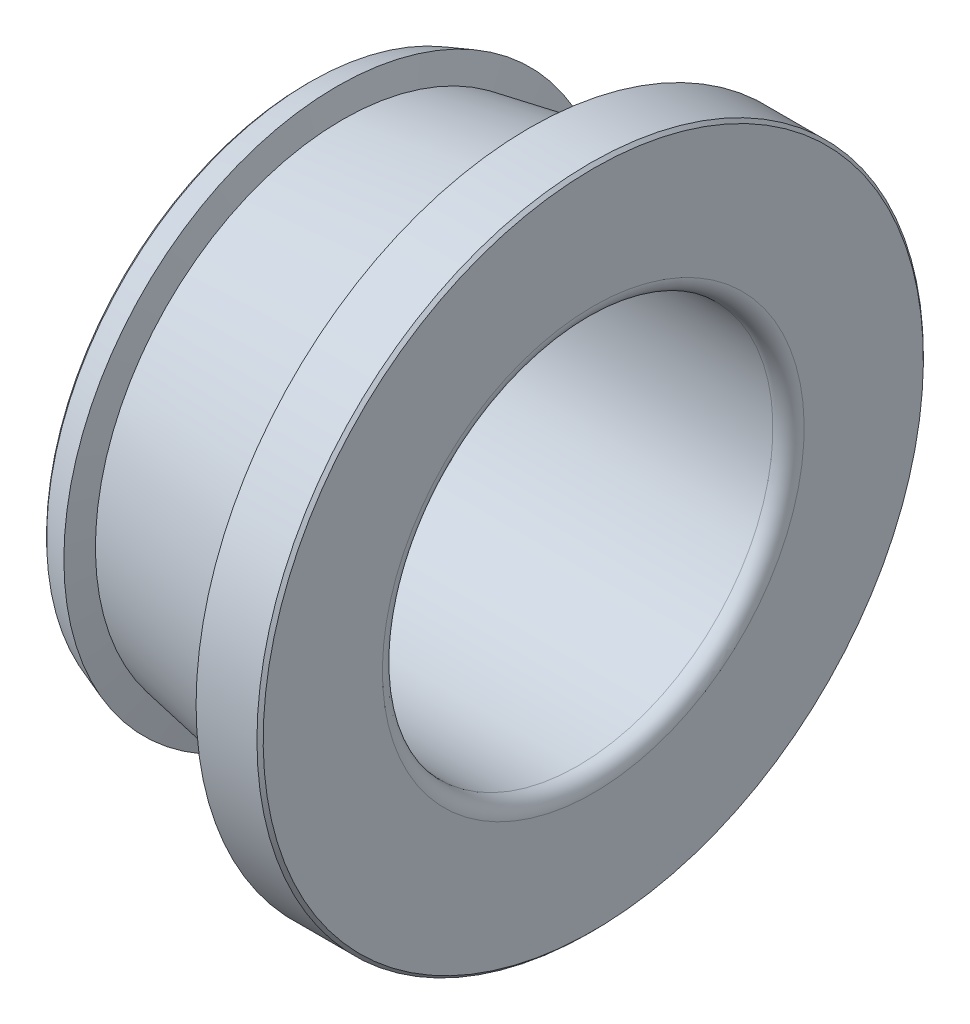
ISO-10303-21;
HEADER;
FILE_DESCRIPTION(('STEP AP214'),'2;1');
FILE_NAME('part.step','',(''),(''),'','','');
FILE_SCHEMA(('AUTOMOTIVE_DESIGN { 1 0 10303 214 1 1 1 1 }'));
ENDSEC;
DATA;
#1=APPLICATION_CONTEXT('core data for automotive mechanical design processes');
#2=APPLICATION_PROTOCOL_DEFINITION('international standard','automotive_design',2000,#1);
#3=PRODUCT_CONTEXT('',#1,'mechanical');
#4=PRODUCT('Part','Part','',(#3));
#5=PRODUCT_RELATED_PRODUCT_CATEGORY('part','',(#4));
#6=PRODUCT_DEFINITION_FORMATION('','',#4);
#7=PRODUCT_DEFINITION_CONTEXT('part definition',#1,'design');
#8=PRODUCT_DEFINITION('design','',#6,#7);
#9=PRODUCT_DEFINITION_SHAPE('','',#8);
#10=(LENGTH_UNIT() NAMED_UNIT(*) SI_UNIT(.MILLI.,.METRE.));
#11=(NAMED_UNIT(*) PLANE_ANGLE_UNIT() SI_UNIT($,.RADIAN.));
#12=(NAMED_UNIT(*) SI_UNIT($,.STERADIAN.) SOLID_ANGLE_UNIT());
#13=UNCERTAINTY_MEASURE_WITH_UNIT(LENGTH_MEASURE(1.E-05),#10,'distance_accuracy_value','');
#14=(GEOMETRIC_REPRESENTATION_CONTEXT(3) GLOBAL_UNCERTAINTY_ASSIGNED_CONTEXT((#13)) GLOBAL_UNIT_ASSIGNED_CONTEXT((#10,
#11,#12)) REPRESENTATION_CONTEXT('',''));
#15=CARTESIAN_POINT('',(0.,0.,0.));
#16=DIRECTION('',(0.,0.,1.));
#17=DIRECTION('',(1.,0.,0.));
#18=AXIS2_PLACEMENT_3D('',#15,#16,#17);
#19=CARTESIAN_POINT('',(4.5975,0.,0.));
#20=DIRECTION('',(1.,0.,0.));
#21=DIRECTION('',(0.,1.,0.));
#22=AXIS2_PLACEMENT_3D('',#19,#20,#21);
#23=CONICAL_SURFACE('',#22,11.46,0.345104263478931);
#24=CARTESIAN_POINT('',(0.87,0.,0.));
#25=DIRECTION('',(1.,0.,0.));
#26=DIRECTION('',(0.,1.,0.));
#27=AXIS2_PLACEMENT_3D('',#24,#25,#26);
#28=CIRCLE('',#27,10.12);
#29=CARTESIAN_POINT('',(0.87,10.12,0.));
#30=VERTEX_POINT('',#29);
#31=EDGE_CURVE('E11',#30,#30,#28,.T.);
#32=ORIENTED_EDGE('',*,*,#31,.T.);
#33=EDGE_LOOP('',(#32));
#34=FACE_BOUND('',#33,.T.);
#35=CARTESIAN_POINT('',(1.90678880248162,0.,0.));
#36=DIRECTION('',(-1.,0.,0.));
#37=DIRECTION('',(0.,1.,0.));
#38=AXIS2_PLACEMENT_3D('',#35,#36,#37);
#39=CIRCLE('',#38,10.4927154917036);
#40=CARTESIAN_POINT('',(1.90678880248162,-10.4927154917036,0.));
#41=VERTEX_POINT('',#40);
#42=EDGE_CURVE('E73',#41,#41,#39,.T.);
#43=ORIENTED_EDGE('',*,*,#42,.T.);
#44=EDGE_LOOP('',(#43));
#45=FACE_BOUND('',#44,.T.);
#46=ADVANCED_FACE('F16',(#34,#45),#23,.T.);
#47=CARTESIAN_POINT('',(0.81,0.,0.));
#48=DIRECTION('',(1.,0.,0.));
#49=DIRECTION('',(0.,1.,0.));
#50=AXIS2_PLACEMENT_3D('',#47,#48,#49);
#51=CONICAL_SURFACE('',#50,10.06,0.785398163397445);
#52=CARTESIAN_POINT('',(0.75,0.,0.));
#53=DIRECTION('',(1.,0.,0.));
#54=DIRECTION('',(0.,1.,0.));
#55=AXIS2_PLACEMENT_3D('',#52,#53,#54);
#56=CIRCLE('',#55,10.);
#57=CARTESIAN_POINT('',(0.75,10.,0.));
#58=VERTEX_POINT('',#57);
#59=EDGE_CURVE('E26',#58,#58,#56,.T.);
#60=ORIENTED_EDGE('',*,*,#59,.T.);
#61=EDGE_LOOP('',(#60));
#62=FACE_BOUND('',#61,.T.);
#63=ORIENTED_EDGE('',*,*,#31,.F.);
#64=EDGE_LOOP('',(#63));
#65=FACE_BOUND('',#64,.T.);
#66=ADVANCED_FACE('F102',(#62,#65),#51,.T.);
#67=CARTESIAN_POINT('',(0.75,8.81,0.));
#68=DIRECTION('',(-1.,0.,0.));
#69=DIRECTION('',(0.,-1.,0.));
#70=AXIS2_PLACEMENT_3D('',#67,#68,#69);
#71=PLANE('',#70);
#72=CARTESIAN_POINT('',(0.75,0.,0.));
#73=DIRECTION('',(1.,0.,0.));
#74=DIRECTION('',(0.,1.,0.));
#75=AXIS2_PLACEMENT_3D('',#72,#73,#74);
#76=CIRCLE('',#75,7.62);
#77=CARTESIAN_POINT('',(0.75,7.62,0.));
#78=VERTEX_POINT('',#77);
#79=EDGE_CURVE('E75',#78,#78,#76,.T.);
#80=ORIENTED_EDGE('',*,*,#79,.T.);
#81=EDGE_LOOP('',(#80));
#82=FACE_BOUND('',#81,.T.);
#83=ORIENTED_EDGE('',*,*,#59,.F.);
#84=EDGE_LOOP('',(#83));
#85=FACE_BOUND('',#84,.T.);
#86=ADVANCED_FACE('F108',(#82,#85),#71,.T.);
#87=CARTESIAN_POINT('',(0.87,0.,0.));
#88=DIRECTION('',(1.,0.,0.));
#89=DIRECTION('',(0.,0.,-1.));
#90=AXIS2_PLACEMENT_3D('',#87,#88,#89);
#91=TOROIDAL_SURFACE('',#90,7.62,0.12);
#92=CARTESIAN_POINT('',(0.87,0.,0.));
#93=DIRECTION('',(1.,0.,0.));
#94=DIRECTION('',(0.,1.,0.));
#95=AXIS2_PLACEMENT_3D('',#92,#93,#94);
#96=CIRCLE('',#95,7.5);
#97=CARTESIAN_POINT('',(0.87,7.5,0.));
#98=VERTEX_POINT('',#97);
#99=EDGE_CURVE('E80',#98,#98,#96,.T.);
#100=ORIENTED_EDGE('',*,*,#99,.T.);
#101=EDGE_LOOP('',(#100));
#102=FACE_BOUND('',#101,.T.);
#103=ORIENTED_EDGE('',*,*,#79,.F.);
#104=EDGE_LOOP('',(#103));
#105=FACE_BOUND('',#104,.T.);
#106=ADVANCED_FACE('F117',(#102,#105),#91,.T.);
#107=CARTESIAN_POINT('',(6.01,0.,0.));
#108=DIRECTION('',(-1.,0.,0.));
#109=DIRECTION('',(0.,1.,0.));
#110=AXIS2_PLACEMENT_3D('',#107,#108,#109);
#111=CYLINDRICAL_SURFACE('',#110,7.5);
#112=CARTESIAN_POINT('',(11.15,0.,0.));
#113=DIRECTION('',(1.,0.,0.));
#114=DIRECTION('',(0.,1.,0.));
#115=AXIS2_PLACEMENT_3D('',#112,#113,#114);
#116=CIRCLE('',#115,7.5);
#117=CARTESIAN_POINT('',(11.15,7.5,0.));
#118=VERTEX_POINT('',#117);
#119=EDGE_CURVE('E77',#118,#118,#116,.T.);
#120=ORIENTED_EDGE('',*,*,#119,.T.);
#121=EDGE_LOOP('',(#120));
#122=FACE_BOUND('',#121,.T.);
#123=ORIENTED_EDGE('',*,*,#99,.F.);
#124=EDGE_LOOP('',(#123));
#125=FACE_BOUND('',#124,.T.);
#126=ADVANCED_FACE('F18',(#122,#125),#111,.F.);
#127=CARTESIAN_POINT('',(11.15,0.,0.));
#128=DIRECTION('',(1.,0.,0.));
#129=DIRECTION('',(0.,0.,-1.));
#130=AXIS2_PLACEMENT_3D('',#127,#128,#129);
#131=TOROIDAL_SURFACE('',#130,8.1,0.6);
#132=CARTESIAN_POINT('',(11.75,0.,0.));
#133=DIRECTION('',(1.,0.,0.));
#134=DIRECTION('',(0.,1.,0.));
#135=AXIS2_PLACEMENT_3D('',#132,#133,#134);
#136=CIRCLE('',#135,8.1);
#137=CARTESIAN_POINT('',(11.75,8.1,0.));
#138=VERTEX_POINT('',#137);
#139=EDGE_CURVE('E71',#138,#138,#136,.T.);
#140=ORIENTED_EDGE('',*,*,#139,.T.);
#141=EDGE_LOOP('',(#140));
#142=FACE_BOUND('',#141,.T.);
#143=ORIENTED_EDGE('',*,*,#119,.F.);
#144=EDGE_LOOP('',(#143));
#145=FACE_BOUND('',#144,.T.);
#146=ADVANCED_FACE('F112',(#142,#145),#131,.T.);
#147=CARTESIAN_POINT('',(11.75,10.39,0.));
#148=DIRECTION('',(1.,0.,0.));
#149=DIRECTION('',(0.,1.,0.));
#150=AXIS2_PLACEMENT_3D('',#147,#148,#149);
#151=PLANE('',#150);
#152=CARTESIAN_POINT('',(11.75,0.,0.));
#153=DIRECTION('',(1.,0.,0.));
#154=DIRECTION('',(0.,1.,0.));
#155=AXIS2_PLACEMENT_3D('',#152,#153,#154);
#156=CIRCLE('',#155,12.68);
#157=CARTESIAN_POINT('',(11.75,12.68,0.));
#158=VERTEX_POINT('',#157);
#159=EDGE_CURVE('E61',#158,#158,#156,.T.);
#160=ORIENTED_EDGE('',*,*,#159,.T.);
#161=EDGE_LOOP('',(#160));
#162=FACE_BOUND('',#161,.T.);
#163=ORIENTED_EDGE('',*,*,#139,.F.);
#164=EDGE_LOOP('',(#163));
#165=FACE_BOUND('',#164,.T.);
#166=ADVANCED_FACE('F128',(#162,#165),#151,.T.);
#167=CARTESIAN_POINT('',(11.69,0.,0.));
#168=DIRECTION('',(-1.,0.,0.));
#169=DIRECTION('',(0.,1.,0.));
#170=AXIS2_PLACEMENT_3D('',#167,#168,#169);
#171=CONICAL_SURFACE('',#170,12.74,0.785398163397448);
#172=CARTESIAN_POINT('',(11.63,0.,0.));
#173=DIRECTION('',(1.,0.,0.));
#174=DIRECTION('',(0.,1.,0.));
#175=AXIS2_PLACEMENT_3D('',#172,#173,#174);
#176=CIRCLE('',#175,12.8);
#177=CARTESIAN_POINT('',(11.63,12.8,0.));
#178=VERTEX_POINT('',#177);
#179=EDGE_CURVE('E66',#178,#178,#176,.T.);
#180=ORIENTED_EDGE('',*,*,#179,.T.);
#181=EDGE_LOOP('',(#180));
#182=FACE_BOUND('',#181,.T.);
#183=ORIENTED_EDGE('',*,*,#159,.F.);
#184=EDGE_LOOP('',(#183));
#185=FACE_BOUND('',#184,.T.);
#186=ADVANCED_FACE('F67',(#182,#185),#171,.T.);
#187=CARTESIAN_POINT('',(9.9775,0.,0.));
#188=DIRECTION('',(-1.,0.,0.));
#189=DIRECTION('',(0.,1.,0.));
#190=AXIS2_PLACEMENT_3D('',#187,#188,#189);
#191=CYLINDRICAL_SURFACE('',#190,12.8);
#192=ORIENTED_EDGE('',*,*,#179,.F.);
#193=EDGE_LOOP('',(#192));
#194=FACE_BOUND('',#193,.T.);
#195=CARTESIAN_POINT('',(9.2923520639752,0.,0.));
#196=DIRECTION('',(1.,0.,0.));
#197=DIRECTION('',(0.,1.,0.));
#198=AXIS2_PLACEMENT_3D('',#195,#196,#197);
#199=CIRCLE('',#198,12.8);
#200=CARTESIAN_POINT('',(9.2923520639752,-12.8,0.));
#201=VERTEX_POINT('',#200);
#202=EDGE_CURVE('E20',#201,#201,#199,.T.);
#203=ORIENTED_EDGE('',*,*,#202,.T.);
#204=EDGE_LOOP('',(#203));
#205=FACE_BOUND('',#204,.T.);
#206=ADVANCED_FACE('F119',(#194,#205),#191,.T.);
#207=CARTESIAN_POINT('',(9.19838887298465,0.,0.));
#208=DIRECTION('',(-1.,0.,0.));
#209=DIRECTION('',(0.,1.,0.));
#210=AXIS2_PLACEMENT_3D('',#207,#208,#209);
#211=CONICAL_SURFACE('',#210,13.2537310871226,1.36659280431156);
#212=CARTESIAN_POINT('',(9.69014806422419,0.,0.));
#213=DIRECTION('',(1.,0.,0.));
#214=DIRECTION('',(0.,1.,0.));
#215=AXIS2_PLACEMENT_3D('',#212,#213,#214);
#216=CIRCLE('',#215,10.8791157713648);
#217=CARTESIAN_POINT('',(9.69014806422419,10.8791157713648,0.));
#218=VERTEX_POINT('',#217);
#219=EDGE_CURVE('E87',#218,#218,#216,.T.);
#220=ORIENTED_EDGE('',*,*,#219,.T.);
#221=EDGE_LOOP('',(#220));
#222=FACE_BOUND('',#221,.T.);
#223=ORIENTED_EDGE('',*,*,#202,.F.);
#224=EDGE_LOOP('',(#223));
#225=FACE_BOUND('',#224,.T.);
#226=ADVANCED_FACE('F97',(#222,#225),#211,.F.);
#227=CARTESIAN_POINT('',(1.65837323119705,0.,0.));
#228=DIRECTION('',(-1.,0.,0.));
#229=DIRECTION('',(0.,1.,0.));
#230=AXIS2_PLACEMENT_3D('',#227,#228,#229);
#231=CONICAL_SURFACE('',#230,11.6922689128774,1.36659280431156);
#232=CARTESIAN_POINT('',(2.11469788870958,0.,0.));
#233=DIRECTION('',(1.,0.,0.));
#234=DIRECTION('',(0.,1.,0.));
#235=AXIS2_PLACEMENT_3D('',#232,#233,#234);
#236=CIRCLE('',#235,9.48876048844752);
#237=CARTESIAN_POINT('',(2.11469788870958,9.48876048844752,0.));
#238=VERTEX_POINT('',#237);
#239=EDGE_CURVE('E89',#238,#238,#236,.T.);
#240=ORIENTED_EDGE('',*,*,#239,.F.);
#241=EDGE_LOOP('',(#240));
#242=FACE_BOUND('',#241,.T.);
#243=ORIENTED_EDGE('',*,*,#42,.F.);
#244=EDGE_LOOP('',(#243));
#245=FACE_BOUND('',#244,.T.);
#246=ADVANCED_FACE('F94',(#242,#245),#231,.T.);
#247=CARTESIAN_POINT('',(5.90242297646689,0.,0.));
#248=DIRECTION('',(1.,0.,0.));
#249=DIRECTION('',(0.,1.,0.));
#250=AXIS2_PLACEMENT_3D('',#247,#248,#249);
#251=CONICAL_SURFACE('',#250,10.1839381299062,0.181514242207411);
#252=ORIENTED_EDGE('',*,*,#219,.F.);
#253=EDGE_LOOP('',(#252));
#254=FACE_BOUND('',#253,.T.);
#255=ORIENTED_EDGE('',*,*,#239,.T.);
#256=EDGE_LOOP('',(#255));
#257=FACE_BOUND('',#256,.T.);
#258=ADVANCED_FACE('F92',(#254,#257),#251,.T.);
#259=CLOSED_SHELL('',(#46,#66,#86,#106,#126,#146,#166,#186,#206,#226,#246,#258));
#260=MANIFOLD_SOLID_BREP('B1',#259);
#261=ADVANCED_BREP_SHAPE_REPRESENTATION('',(#18,#260),#14);
#262=SHAPE_DEFINITION_REPRESENTATION(#9,#261);
ENDSEC;
END-ISO-10303-21;
